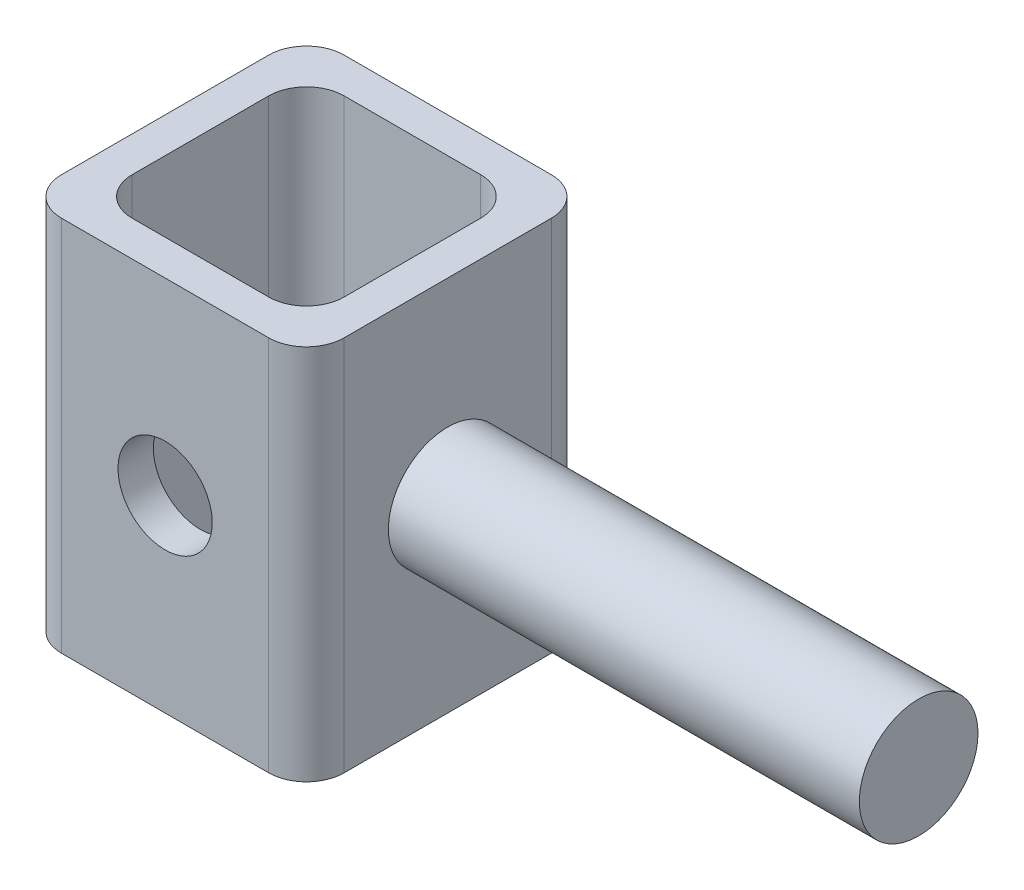
ISO-10303-21;
HEADER;
FILE_DESCRIPTION(('STEP AP214'),'2;1');
FILE_NAME('part.step','',(''),(''),'','','');
FILE_SCHEMA(('AUTOMOTIVE_DESIGN { 1 0 10303 214 1 1 1 1 }'));
ENDSEC;
DATA;
#1=APPLICATION_CONTEXT('core data for automotive mechanical design processes');
#2=APPLICATION_PROTOCOL_DEFINITION('international standard','automotive_design',2000,#1);
#3=PRODUCT_CONTEXT('',#1,'mechanical');
#4=PRODUCT('Part','Part','',(#3));
#5=PRODUCT_RELATED_PRODUCT_CATEGORY('part','',(#4));
#6=PRODUCT_DEFINITION_FORMATION('','',#4);
#7=PRODUCT_DEFINITION_CONTEXT('part definition',#1,'design');
#8=PRODUCT_DEFINITION('design','',#6,#7);
#9=PRODUCT_DEFINITION_SHAPE('','',#8);
#10=(LENGTH_UNIT() NAMED_UNIT(*) SI_UNIT(.MILLI.,.METRE.));
#11=(NAMED_UNIT(*) PLANE_ANGLE_UNIT() SI_UNIT($,.RADIAN.));
#12=(NAMED_UNIT(*) SI_UNIT($,.STERADIAN.) SOLID_ANGLE_UNIT());
#13=UNCERTAINTY_MEASURE_WITH_UNIT(LENGTH_MEASURE(1.E-05),#10,'distance_accuracy_value','');
#14=(GEOMETRIC_REPRESENTATION_CONTEXT(3) GLOBAL_UNCERTAINTY_ASSIGNED_CONTEXT((#13)) GLOBAL_UNIT_ASSIGNED_CONTEXT((#10,
#11,#12)) REPRESENTATION_CONTEXT('',''));
#15=CARTESIAN_POINT('',(0.,0.,0.));
#16=DIRECTION('',(0.,0.,1.));
#17=DIRECTION('',(1.,0.,0.));
#18=AXIS2_PLACEMENT_3D('',#15,#16,#17);
#19=CARTESIAN_POINT('',(0.,25.4,0.));
#20=DIRECTION('',(0.,-1.,0.));
#21=DIRECTION('',(0.,0.,-1.));
#22=AXIS2_PLACEMENT_3D('',#19,#20,#21);
#23=PLANE('',#22);
#24=DIRECTION('',(1.,0.,0.));
#25=VECTOR('',#24,1.);
#26=CARTESIAN_POINT('',(0.,25.4,0.));
#27=LINE('',#26,#25);
#28=CARTESIAN_POINT('',(2.54,25.4,0.));
#29=VERTEX_POINT('',#28);
#30=CARTESIAN_POINT('',(16.51,25.4,0.));
#31=VERTEX_POINT('',#30);
#32=EDGE_CURVE('E325',#29,#31,#27,.T.);
#33=ORIENTED_EDGE('',*,*,#32,.T.);
#34=CARTESIAN_POINT('',(16.51,25.4,-2.54));
#35=DIRECTION('',(0.,-1.,0.));
#36=DIRECTION('',(0.,0.,-1.));
#37=AXIS2_PLACEMENT_3D('',#34,#35,#36);
#38=CIRCLE('',#37,2.54);
#39=CARTESIAN_POINT('',(19.05,25.4,-2.54));
#40=VERTEX_POINT('',#39);
#41=EDGE_CURVE('E248',#31,#40,#38,.F.);
#42=ORIENTED_EDGE('',*,*,#41,.T.);
#43=DIRECTION('',(0.,0.,-1.));
#44=VECTOR('',#43,1.);
#45=CARTESIAN_POINT('',(19.05,25.4,0.));
#46=LINE('',#45,#44);
#47=CARTESIAN_POINT('',(19.05,25.4,-16.51));
#48=VERTEX_POINT('',#47);
#49=EDGE_CURVE('E329',#40,#48,#46,.T.);
#50=ORIENTED_EDGE('',*,*,#49,.T.);
#51=CARTESIAN_POINT('',(16.51,25.4,-16.51));
#52=DIRECTION('',(0.,-1.,0.));
#53=DIRECTION('',(0.,0.,-1.));
#54=AXIS2_PLACEMENT_3D('',#51,#52,#53);
#55=CIRCLE('',#54,2.54);
#56=CARTESIAN_POINT('',(16.51,25.4,-19.05));
#57=VERTEX_POINT('',#56);
#58=EDGE_CURVE('E62',#48,#57,#55,.F.);
#59=ORIENTED_EDGE('',*,*,#58,.T.);
#60=DIRECTION('',(-1.,0.,0.));
#61=VECTOR('',#60,1.);
#62=CARTESIAN_POINT('',(0.,25.4,-19.05));
#63=LINE('',#62,#61);
#64=CARTESIAN_POINT('',(2.54,25.4,-19.05));
#65=VERTEX_POINT('',#64);
#66=EDGE_CURVE('E189',#57,#65,#63,.T.);
#67=ORIENTED_EDGE('',*,*,#66,.T.);
#68=CARTESIAN_POINT('',(2.54,25.4,-16.51));
#69=DIRECTION('',(0.,-1.,0.));
#70=DIRECTION('',(0.,0.,-1.));
#71=AXIS2_PLACEMENT_3D('',#68,#69,#70);
#72=CIRCLE('',#71,2.54);
#73=CARTESIAN_POINT('',(0.,25.4,-16.51));
#74=VERTEX_POINT('',#73);
#75=EDGE_CURVE('E242',#65,#74,#72,.F.);
#76=ORIENTED_EDGE('',*,*,#75,.T.);
#77=DIRECTION('',(0.,0.,1.));
#78=VECTOR('',#77,1.);
#79=CARTESIAN_POINT('',(0.,25.4,0.));
#80=LINE('',#79,#78);
#81=CARTESIAN_POINT('',(0.,25.4,-2.54));
#82=VERTEX_POINT('',#81);
#83=EDGE_CURVE('E321',#74,#82,#80,.T.);
#84=ORIENTED_EDGE('',*,*,#83,.T.);
#85=CARTESIAN_POINT('',(2.54,25.4,-2.54));
#86=DIRECTION('',(0.,-1.,0.));
#87=DIRECTION('',(0.,0.,-1.));
#88=AXIS2_PLACEMENT_3D('',#85,#86,#87);
#89=CIRCLE('',#88,2.54);
#90=EDGE_CURVE('E245',#82,#29,#89,.F.);
#91=ORIENTED_EDGE('',*,*,#90,.T.);
#92=EDGE_LOOP('',(#33,#42,#50,#59,#67,#76,#84,#91));
#93=FACE_BOUND('',#92,.T.);
#94=DIRECTION('',(0.,0.,1.));
#95=VECTOR('',#94,1.);
#96=CARTESIAN_POINT('',(2.38125,25.4,-2.38125));
#97=LINE('',#96,#95);
#98=CARTESIAN_POINT('',(2.38125,25.4,-14.12875));
#99=VERTEX_POINT('',#98);
#100=CARTESIAN_POINT('',(2.38125,25.4,-4.92125));
#101=VERTEX_POINT('',#100);
#102=EDGE_CURVE('E300',#99,#101,#97,.T.);
#103=ORIENTED_EDGE('',*,*,#102,.F.);
#104=CARTESIAN_POINT('',(4.92125,25.4,-14.12875));
#105=DIRECTION('',(0.,-1.,0.));
#106=DIRECTION('',(0.,0.,-1.));
#107=AXIS2_PLACEMENT_3D('',#104,#105,#106);
#108=CIRCLE('',#107,2.54);
#109=CARTESIAN_POINT('',(4.92125,25.4,-16.66875));
#110=VERTEX_POINT('',#109);
#111=EDGE_CURVE('E11',#99,#110,#108,.T.);
#112=ORIENTED_EDGE('',*,*,#111,.T.);
#113=DIRECTION('',(-1.,0.,0.));
#114=VECTOR('',#113,1.);
#115=CARTESIAN_POINT('',(2.38125,25.4,-16.66875));
#116=LINE('',#115,#114);
#117=CARTESIAN_POINT('',(14.12875,25.4,-16.66875));
#118=VERTEX_POINT('',#117);
#119=EDGE_CURVE('E298',#118,#110,#116,.T.);
#120=ORIENTED_EDGE('',*,*,#119,.F.);
#121=CARTESIAN_POINT('',(14.12875,25.4,-14.12875));
#122=DIRECTION('',(0.,-1.,0.));
#123=DIRECTION('',(0.,0.,-1.));
#124=AXIS2_PLACEMENT_3D('',#121,#122,#123);
#125=CIRCLE('',#124,2.54);
#126=CARTESIAN_POINT('',(16.66875,25.4,-14.12875));
#127=VERTEX_POINT('',#126);
#128=EDGE_CURVE('E166',#118,#127,#125,.T.);
#129=ORIENTED_EDGE('',*,*,#128,.T.);
#130=DIRECTION('',(0.,0.,-1.));
#131=VECTOR('',#130,1.);
#132=CARTESIAN_POINT('',(16.66875,25.4,-2.38125));
#133=LINE('',#132,#131);
#134=CARTESIAN_POINT('',(16.66875,25.4,-4.92125));
#135=VERTEX_POINT('',#134);
#136=EDGE_CURVE('E306',#135,#127,#133,.T.);
#137=ORIENTED_EDGE('',*,*,#136,.F.);
#138=CARTESIAN_POINT('',(14.12875,25.4,-4.92125));
#139=DIRECTION('',(0.,-1.,0.));
#140=DIRECTION('',(0.,0.,-1.));
#141=AXIS2_PLACEMENT_3D('',#138,#139,#140);
#142=CIRCLE('',#141,2.54);
#143=CARTESIAN_POINT('',(14.12875,25.4,-2.38125));
#144=VERTEX_POINT('',#143);
#145=EDGE_CURVE('E165',#135,#144,#142,.T.);
#146=ORIENTED_EDGE('',*,*,#145,.T.);
#147=DIRECTION('',(1.,0.,0.));
#148=VECTOR('',#147,1.);
#149=CARTESIAN_POINT('',(2.38125,25.4,-2.38125));
#150=LINE('',#149,#148);
#151=CARTESIAN_POINT('',(4.92125,25.4,-2.38125));
#152=VERTEX_POINT('',#151);
#153=EDGE_CURVE('E313',#152,#144,#150,.T.);
#154=ORIENTED_EDGE('',*,*,#153,.F.);
#155=CARTESIAN_POINT('',(4.92125,25.4,-4.92125));
#156=DIRECTION('',(0.,-1.,0.));
#157=DIRECTION('',(0.,0.,-1.));
#158=AXIS2_PLACEMENT_3D('',#155,#156,#157);
#159=CIRCLE('',#158,2.54);
#160=EDGE_CURVE('E274',#152,#101,#159,.T.);
#161=ORIENTED_EDGE('',*,*,#160,.T.);
#162=EDGE_LOOP('',(#103,#112,#120,#129,#137,#146,#154,#161));
#163=FACE_BOUND('',#162,.T.);
#164=ADVANCED_FACE('F39',(#93,#163),#23,.F.);
#165=CARTESIAN_POINT('',(0.,0.,0.));
#166=DIRECTION('',(0.,-1.,0.));
#167=DIRECTION('',(0.,0.,-1.));
#168=AXIS2_PLACEMENT_3D('',#165,#166,#167);
#169=PLANE('',#168);
#170=DIRECTION('',(0.,0.,-1.));
#171=VECTOR('',#170,1.);
#172=CARTESIAN_POINT('',(19.05,0.,0.));
#173=LINE('',#172,#171);
#174=CARTESIAN_POINT('',(19.05,0.,-2.54));
#175=VERTEX_POINT('',#174);
#176=CARTESIAN_POINT('',(19.05,0.,-16.51));
#177=VERTEX_POINT('',#176);
#178=EDGE_CURVE('E336',#175,#177,#173,.T.);
#179=ORIENTED_EDGE('',*,*,#178,.F.);
#180=CARTESIAN_POINT('',(16.51,0.,-2.54));
#181=DIRECTION('',(0.,-1.,0.));
#182=DIRECTION('',(0.,0.,-1.));
#183=AXIS2_PLACEMENT_3D('',#180,#181,#182);
#184=CIRCLE('',#183,2.54);
#185=CARTESIAN_POINT('',(16.51,0.,0.));
#186=VERTEX_POINT('',#185);
#187=EDGE_CURVE('E230',#175,#186,#184,.T.);
#188=ORIENTED_EDGE('',*,*,#187,.T.);
#189=DIRECTION('',(1.,0.,0.));
#190=VECTOR('',#189,1.);
#191=CARTESIAN_POINT('',(0.,0.,0.));
#192=LINE('',#191,#190);
#193=CARTESIAN_POINT('',(2.54,0.,0.));
#194=VERTEX_POINT('',#193);
#195=EDGE_CURVE('E311',#194,#186,#192,.T.);
#196=ORIENTED_EDGE('',*,*,#195,.F.);
#197=CARTESIAN_POINT('',(2.54,0.,-2.54));
#198=DIRECTION('',(0.,-1.,0.));
#199=DIRECTION('',(0.,0.,-1.));
#200=AXIS2_PLACEMENT_3D('',#197,#198,#199);
#201=CIRCLE('',#200,2.54);
#202=CARTESIAN_POINT('',(0.,0.,-2.54));
#203=VERTEX_POINT('',#202);
#204=EDGE_CURVE('E227',#194,#203,#201,.T.);
#205=ORIENTED_EDGE('',*,*,#204,.T.);
#206=DIRECTION('',(0.,0.,1.));
#207=VECTOR('',#206,1.);
#208=CARTESIAN_POINT('',(0.,0.,0.));
#209=LINE('',#208,#207);
#210=CARTESIAN_POINT('',(0.,0.,-16.51));
#211=VERTEX_POINT('',#210);
#212=EDGE_CURVE('E305',#211,#203,#209,.T.);
#213=ORIENTED_EDGE('',*,*,#212,.F.);
#214=CARTESIAN_POINT('',(2.54,0.,-16.51));
#215=DIRECTION('',(0.,-1.,0.));
#216=DIRECTION('',(0.,0.,-1.));
#217=AXIS2_PLACEMENT_3D('',#214,#215,#216);
#218=CIRCLE('',#217,2.54);
#219=CARTESIAN_POINT('',(2.54,0.,-19.05));
#220=VERTEX_POINT('',#219);
#221=EDGE_CURVE('E224',#211,#220,#218,.T.);
#222=ORIENTED_EDGE('',*,*,#221,.T.);
#223=DIRECTION('',(-1.,0.,0.));
#224=VECTOR('',#223,1.);
#225=CARTESIAN_POINT('',(0.,0.,-19.05));
#226=LINE('',#225,#224);
#227=CARTESIAN_POINT('',(16.51,0.,-19.05));
#228=VERTEX_POINT('',#227);
#229=EDGE_CURVE('E192',#228,#220,#226,.T.);
#230=ORIENTED_EDGE('',*,*,#229,.F.);
#231=CARTESIAN_POINT('',(16.51,0.,-16.51));
#232=DIRECTION('',(0.,-1.,0.));
#233=DIRECTION('',(0.,0.,-1.));
#234=AXIS2_PLACEMENT_3D('',#231,#232,#233);
#235=CIRCLE('',#234,2.54);
#236=EDGE_CURVE('E221',#228,#177,#235,.T.);
#237=ORIENTED_EDGE('',*,*,#236,.T.);
#238=EDGE_LOOP('',(#179,#188,#196,#205,#213,#222,#230,#237));
#239=FACE_BOUND('',#238,.T.);
#240=DIRECTION('',(0.,0.,-1.));
#241=VECTOR('',#240,1.);
#242=CARTESIAN_POINT('',(16.66875,0.,-2.38125));
#243=LINE('',#242,#241);
#244=CARTESIAN_POINT('',(16.66875,0.,-4.92125));
#245=VERTEX_POINT('',#244);
#246=CARTESIAN_POINT('',(16.66875,0.,-14.12875));
#247=VERTEX_POINT('',#246);
#248=EDGE_CURVE('E157',#245,#247,#243,.T.);
#249=ORIENTED_EDGE('',*,*,#248,.T.);
#250=CARTESIAN_POINT('',(14.12875,0.,-14.12875));
#251=DIRECTION('',(0.,-1.,0.));
#252=DIRECTION('',(0.,0.,-1.));
#253=AXIS2_PLACEMENT_3D('',#250,#251,#252);
#254=CIRCLE('',#253,2.54);
#255=CARTESIAN_POINT('',(14.12875,0.,-16.66875));
#256=VERTEX_POINT('',#255);
#257=EDGE_CURVE('E264',#247,#256,#254,.F.);
#258=ORIENTED_EDGE('',*,*,#257,.T.);
#259=DIRECTION('',(-1.,0.,0.));
#260=VECTOR('',#259,1.);
#261=CARTESIAN_POINT('',(2.38125,0.,-16.66875));
#262=LINE('',#261,#260);
#263=CARTESIAN_POINT('',(4.92125,0.,-16.66875));
#264=VERTEX_POINT('',#263);
#265=EDGE_CURVE('E177',#256,#264,#262,.T.);
#266=ORIENTED_EDGE('',*,*,#265,.T.);
#267=CARTESIAN_POINT('',(4.92125,0.,-14.12875));
#268=DIRECTION('',(0.,-1.,0.));
#269=DIRECTION('',(0.,0.,-1.));
#270=AXIS2_PLACEMENT_3D('',#267,#268,#269);
#271=CIRCLE('',#270,2.54);
#272=CARTESIAN_POINT('',(2.38125,0.,-14.12875));
#273=VERTEX_POINT('',#272);
#274=EDGE_CURVE('E48',#264,#273,#271,.F.);
#275=ORIENTED_EDGE('',*,*,#274,.T.);
#276=DIRECTION('',(0.,0.,1.));
#277=VECTOR('',#276,1.);
#278=CARTESIAN_POINT('',(2.38125,0.,-2.38125));
#279=LINE('',#278,#277);
#280=CARTESIAN_POINT('',(2.38125,0.,-4.92125));
#281=VERTEX_POINT('',#280);
#282=EDGE_CURVE('E280',#273,#281,#279,.T.);
#283=ORIENTED_EDGE('',*,*,#282,.T.);
#284=CARTESIAN_POINT('',(4.92125,0.,-4.92125));
#285=DIRECTION('',(0.,-1.,0.));
#286=DIRECTION('',(0.,0.,-1.));
#287=AXIS2_PLACEMENT_3D('',#284,#285,#286);
#288=CIRCLE('',#287,2.54);
#289=CARTESIAN_POINT('',(4.92125,0.,-2.38125));
#290=VERTEX_POINT('',#289);
#291=EDGE_CURVE('E271',#281,#290,#288,.F.);
#292=ORIENTED_EDGE('',*,*,#291,.T.);
#293=DIRECTION('',(1.,0.,0.));
#294=VECTOR('',#293,1.);
#295=CARTESIAN_POINT('',(2.38125,0.,-2.38125));
#296=LINE('',#295,#294);
#297=CARTESIAN_POINT('',(14.12875,0.,-2.38125));
#298=VERTEX_POINT('',#297);
#299=EDGE_CURVE('E159',#290,#298,#296,.T.);
#300=ORIENTED_EDGE('',*,*,#299,.T.);
#301=CARTESIAN_POINT('',(14.12875,0.,-4.92125));
#302=DIRECTION('',(0.,-1.,0.));
#303=DIRECTION('',(0.,0.,-1.));
#304=AXIS2_PLACEMENT_3D('',#301,#302,#303);
#305=CIRCLE('',#304,2.54);
#306=EDGE_CURVE('E154',#298,#245,#305,.F.);
#307=ORIENTED_EDGE('',*,*,#306,.T.);
#308=EDGE_LOOP('',(#249,#258,#266,#275,#283,#292,#300,#307));
#309=FACE_BOUND('',#308,.T.);
#310=ADVANCED_FACE('F156',(#239,#309),#169,.T.);
#311=CARTESIAN_POINT('',(0.,25.4,0.));
#312=DIRECTION('',(1.,0.,0.));
#313=DIRECTION('',(0.,0.,-1.));
#314=AXIS2_PLACEMENT_3D('',#311,#312,#313);
#315=PLANE('',#314);
#316=ORIENTED_EDGE('',*,*,#212,.T.);
#317=DIRECTION('',(0.,-1.,0.));
#318=VECTOR('',#317,1.);
#319=CARTESIAN_POINT('',(0.,25.4,-2.54));
#320=LINE('',#319,#318);
#321=EDGE_CURVE('E255',#203,#82,#320,.F.);
#322=ORIENTED_EDGE('',*,*,#321,.T.);
#323=ORIENTED_EDGE('',*,*,#83,.F.);
#324=DIRECTION('',(0.,-1.,0.));
#325=VECTOR('',#324,1.);
#326=CARTESIAN_POINT('',(0.,25.4,-16.51));
#327=LINE('',#326,#325);
#328=EDGE_CURVE('E251',#74,#211,#327,.T.);
#329=ORIENTED_EDGE('',*,*,#328,.T.);
#330=EDGE_LOOP('',(#316,#322,#323,#329));
#331=FACE_BOUND('',#330,.T.);
#332=ADVANCED_FACE('F354',(#331),#315,.F.);
#333=CARTESIAN_POINT('',(0.,25.4,0.));
#334=DIRECTION('',(0.,0.,-1.));
#335=DIRECTION('',(-1.,0.,0.));
#336=AXIS2_PLACEMENT_3D('',#333,#334,#335);
#337=PLANE('',#336);
#338=CARTESIAN_POINT('',(9.525,12.7,0.));
#339=DIRECTION('',(0.,0.,1.));
#340=DIRECTION('',(1.,0.,0.));
#341=AXIS2_PLACEMENT_3D('',#338,#339,#340);
#342=CIRCLE('',#341,3.175);
#343=CARTESIAN_POINT('',(12.7,12.7,0.));
#344=VERTEX_POINT('',#343);
#345=EDGE_CURVE('E291',#344,#344,#342,.T.);
#346=ORIENTED_EDGE('',*,*,#345,.F.);
#347=EDGE_LOOP('',(#346));
#348=FACE_BOUND('',#347,.T.);
#349=ORIENTED_EDGE('',*,*,#195,.T.);
#350=DIRECTION('',(0.,-1.,0.));
#351=VECTOR('',#350,1.);
#352=CARTESIAN_POINT('',(16.51,25.4,0.));
#353=LINE('',#352,#351);
#354=EDGE_CURVE('E237',#186,#31,#353,.F.);
#355=ORIENTED_EDGE('',*,*,#354,.T.);
#356=ORIENTED_EDGE('',*,*,#32,.F.);
#357=DIRECTION('',(0.,-1.,0.));
#358=VECTOR('',#357,1.);
#359=CARTESIAN_POINT('',(2.54,25.4,0.));
#360=LINE('',#359,#358);
#361=EDGE_CURVE('E233',#29,#194,#360,.T.);
#362=ORIENTED_EDGE('',*,*,#361,.T.);
#363=EDGE_LOOP('',(#349,#355,#356,#362));
#364=FACE_BOUND('',#363,.T.);
#365=ADVANCED_FACE('F363',(#348,#364),#337,.F.);
#366=CARTESIAN_POINT('',(19.05,25.4,0.));
#367=DIRECTION('',(-1.,0.,0.));
#368=DIRECTION('',(0.,0.,1.));
#369=AXIS2_PLACEMENT_3D('',#366,#367,#368);
#370=PLANE('',#369);
#371=CARTESIAN_POINT('',(19.05,12.7,-9.525));
#372=DIRECTION('',(1.,0.,0.));
#373=DIRECTION('',(0.,0.,-1.));
#374=AXIS2_PLACEMENT_3D('',#371,#372,#373);
#375=CIRCLE('',#374,4.);
#376=CARTESIAN_POINT('',(19.05,12.7,-13.525));
#377=VERTEX_POINT('',#376);
#378=EDGE_CURVE('E182',#377,#377,#375,.T.);
#379=ORIENTED_EDGE('',*,*,#378,.F.);
#380=EDGE_LOOP('',(#379));
#381=FACE_BOUND('',#380,.T.);
#382=ORIENTED_EDGE('',*,*,#49,.F.);
#383=DIRECTION('',(0.,-1.,0.));
#384=VECTOR('',#383,1.);
#385=CARTESIAN_POINT('',(19.05,25.4,-2.54));
#386=LINE('',#385,#384);
#387=EDGE_CURVE('E217',#40,#175,#386,.T.);
#388=ORIENTED_EDGE('',*,*,#387,.T.);
#389=ORIENTED_EDGE('',*,*,#178,.T.);
#390=DIRECTION('',(0.,-1.,0.));
#391=VECTOR('',#390,1.);
#392=CARTESIAN_POINT('',(19.05,25.4,-16.51));
#393=LINE('',#392,#391);
#394=EDGE_CURVE('E214',#177,#48,#393,.F.);
#395=ORIENTED_EDGE('',*,*,#394,.T.);
#396=EDGE_LOOP('',(#382,#388,#389,#395));
#397=FACE_BOUND('',#396,.T.);
#398=ADVANCED_FACE('F370',(#381,#397),#370,.F.);
#399=CARTESIAN_POINT('',(0.,25.4,-19.05));
#400=DIRECTION('',(0.,0.,1.));
#401=DIRECTION('',(1.,0.,0.));
#402=AXIS2_PLACEMENT_3D('',#399,#400,#401);
#403=PLANE('',#402);
#404=ORIENTED_EDGE('',*,*,#229,.T.);
#405=DIRECTION('',(0.,-1.,0.));
#406=VECTOR('',#405,1.);
#407=CARTESIAN_POINT('',(2.54,25.4,-19.05));
#408=LINE('',#407,#406);
#409=EDGE_CURVE('E55',#220,#65,#408,.F.);
#410=ORIENTED_EDGE('',*,*,#409,.T.);
#411=ORIENTED_EDGE('',*,*,#66,.F.);
#412=DIRECTION('',(0.,-1.,0.));
#413=VECTOR('',#412,1.);
#414=CARTESIAN_POINT('',(16.51,25.4,-19.05));
#415=LINE('',#414,#413);
#416=EDGE_CURVE('E258',#57,#228,#415,.T.);
#417=ORIENTED_EDGE('',*,*,#416,.T.);
#418=EDGE_LOOP('',(#404,#410,#411,#417));
#419=FACE_BOUND('',#418,.T.);
#420=ADVANCED_FACE('F344',(#419),#403,.F.);
#421=CARTESIAN_POINT('',(2.38125,25.4,-2.38125));
#422=DIRECTION('',(1.,0.,0.));
#423=DIRECTION('',(0.,0.,-1.));
#424=AXIS2_PLACEMENT_3D('',#421,#422,#423);
#425=PLANE('',#424);
#426=ORIENTED_EDGE('',*,*,#102,.T.);
#427=DIRECTION('',(0.,-1.,0.));
#428=VECTOR('',#427,1.);
#429=CARTESIAN_POINT('',(2.38125,0.,-4.92125));
#430=LINE('',#429,#428);
#431=EDGE_CURVE('E210',#101,#281,#430,.T.);
#432=ORIENTED_EDGE('',*,*,#431,.T.);
#433=ORIENTED_EDGE('',*,*,#282,.F.);
#434=DIRECTION('',(0.,-1.,0.));
#435=VECTOR('',#434,1.);
#436=CARTESIAN_POINT('',(2.38125,25.4,-14.12875));
#437=LINE('',#436,#435);
#438=EDGE_CURVE('E207',#273,#99,#437,.F.);
#439=ORIENTED_EDGE('',*,*,#438,.T.);
#440=EDGE_LOOP('',(#426,#432,#433,#439));
#441=FACE_BOUND('',#440,.T.);
#442=ADVANCED_FACE('F287',(#441),#425,.T.);
#443=CARTESIAN_POINT('',(2.38125,25.4,-2.38125));
#444=DIRECTION('',(0.,0.,-1.));
#445=DIRECTION('',(-1.,0.,0.));
#446=AXIS2_PLACEMENT_3D('',#443,#444,#445);
#447=PLANE('',#446);
#448=CARTESIAN_POINT('',(9.525,12.7,-2.38125));
#449=DIRECTION('',(0.,0.,-1.));
#450=DIRECTION('',(-1.,0.,0.));
#451=AXIS2_PLACEMENT_3D('',#448,#449,#450);
#452=CIRCLE('',#451,3.175);
#453=CARTESIAN_POINT('',(6.35,12.7,-2.38125));
#454=VERTEX_POINT('',#453);
#455=EDGE_CURVE('E555',#454,#454,#452,.F.);
#456=ORIENTED_EDGE('',*,*,#455,.T.);
#457=EDGE_LOOP('',(#456));
#458=FACE_BOUND('',#457,.T.);
#459=ORIENTED_EDGE('',*,*,#153,.T.);
#460=DIRECTION('',(0.,-1.,0.));
#461=VECTOR('',#460,1.);
#462=CARTESIAN_POINT('',(14.12875,0.,-2.38125));
#463=LINE('',#462,#461);
#464=EDGE_CURVE('E204',#144,#298,#463,.T.);
#465=ORIENTED_EDGE('',*,*,#464,.T.);
#466=ORIENTED_EDGE('',*,*,#299,.F.);
#467=DIRECTION('',(0.,-1.,0.));
#468=VECTOR('',#467,1.);
#469=CARTESIAN_POINT('',(4.92125,25.4,-2.38125));
#470=LINE('',#469,#468);
#471=EDGE_CURVE('E201',#290,#152,#470,.F.);
#472=ORIENTED_EDGE('',*,*,#471,.T.);
#473=EDGE_LOOP('',(#459,#465,#466,#472));
#474=FACE_BOUND('',#473,.T.);
#475=ADVANCED_FACE('F474',(#458,#474),#447,.T.);
#476=CARTESIAN_POINT('',(16.66875,25.4,-2.38125));
#477=DIRECTION('',(-1.,0.,0.));
#478=DIRECTION('',(0.,0.,1.));
#479=AXIS2_PLACEMENT_3D('',#476,#477,#478);
#480=PLANE('',#479);
#481=ORIENTED_EDGE('',*,*,#136,.T.);
#482=DIRECTION('',(0.,-1.,0.));
#483=VECTOR('',#482,1.);
#484=CARTESIAN_POINT('',(16.66875,0.,-14.12875));
#485=LINE('',#484,#483);
#486=EDGE_CURVE('E175',#127,#247,#485,.T.);
#487=ORIENTED_EDGE('',*,*,#486,.T.);
#488=ORIENTED_EDGE('',*,*,#248,.F.);
#489=DIRECTION('',(0.,-1.,0.));
#490=VECTOR('',#489,1.);
#491=CARTESIAN_POINT('',(16.66875,25.4,-4.92125));
#492=LINE('',#491,#490);
#493=EDGE_CURVE('E172',#245,#135,#492,.F.);
#494=ORIENTED_EDGE('',*,*,#493,.T.);
#495=EDGE_LOOP('',(#481,#487,#488,#494));
#496=FACE_BOUND('',#495,.T.);
#497=ADVANCED_FACE('F171',(#496),#480,.T.);
#498=CARTESIAN_POINT('',(2.38125,25.4,-16.66875));
#499=DIRECTION('',(0.,0.,1.));
#500=DIRECTION('',(1.,0.,0.));
#501=AXIS2_PLACEMENT_3D('',#498,#499,#500);
#502=PLANE('',#501);
#503=ORIENTED_EDGE('',*,*,#265,.F.);
#504=DIRECTION('',(0.,-1.,0.));
#505=VECTOR('',#504,1.);
#506=CARTESIAN_POINT('',(14.12875,25.4,-16.66875));
#507=LINE('',#506,#505);
#508=EDGE_CURVE('E198',#256,#118,#507,.F.);
#509=ORIENTED_EDGE('',*,*,#508,.T.);
#510=ORIENTED_EDGE('',*,*,#119,.T.);
#511=DIRECTION('',(0.,-1.,0.));
#512=VECTOR('',#511,1.);
#513=CARTESIAN_POINT('',(4.92125,0.,-16.66875));
#514=LINE('',#513,#512);
#515=EDGE_CURVE('E186',#110,#264,#514,.T.);
#516=ORIENTED_EDGE('',*,*,#515,.T.);
#517=EDGE_LOOP('',(#503,#509,#510,#516));
#518=FACE_BOUND('',#517,.T.);
#519=ADVANCED_FACE('F302',(#518),#502,.T.);
#520=CARTESIAN_POINT('',(9.525,12.7,-19.051));
#521=DIRECTION('',(0.,0.,1.));
#522=DIRECTION('',(1.,0.,0.));
#523=AXIS2_PLACEMENT_3D('',#520,#521,#522);
#524=CYLINDRICAL_SURFACE('',#523,3.175);
#525=ORIENTED_EDGE('',*,*,#455,.F.);
#526=EDGE_LOOP('',(#525));
#527=FACE_BOUND('',#526,.T.);
#528=ORIENTED_EDGE('',*,*,#345,.T.);
#529=EDGE_LOOP('',(#528));
#530=FACE_BOUND('',#529,.T.);
#531=ADVANCED_FACE('F463',(#527,#530),#524,.F.);
#532=CARTESIAN_POINT('',(50.8,12.7,-9.525));
#533=DIRECTION('',(-1.,0.,0.));
#534=DIRECTION('',(0.,0.,1.));
#535=AXIS2_PLACEMENT_3D('',#532,#533,#534);
#536=CYLINDRICAL_SURFACE('',#535,4.);
#537=CARTESIAN_POINT('',(50.8,12.7,-9.525));
#538=DIRECTION('',(1.,0.,0.));
#539=DIRECTION('',(0.,0.,-1.));
#540=AXIS2_PLACEMENT_3D('',#537,#538,#539);
#541=CIRCLE('',#540,4.);
#542=CARTESIAN_POINT('',(50.8,12.7,-13.525));
#543=VERTEX_POINT('',#542);
#544=EDGE_CURVE('E561',#543,#543,#541,.T.);
#545=ORIENTED_EDGE('',*,*,#544,.F.);
#546=EDGE_LOOP('',(#545));
#547=FACE_BOUND('',#546,.T.);
#548=ORIENTED_EDGE('',*,*,#378,.T.);
#549=EDGE_LOOP('',(#548));
#550=FACE_BOUND('',#549,.T.);
#551=ADVANCED_FACE('F531',(#547,#550),#536,.T.);
#552=CARTESIAN_POINT('',(50.8,12.7,-9.525));
#553=DIRECTION('',(1.,0.,0.));
#554=DIRECTION('',(0.,0.,-1.));
#555=AXIS2_PLACEMENT_3D('',#552,#553,#554);
#556=PLANE('',#555);
#557=ORIENTED_EDGE('',*,*,#544,.T.);
#558=EDGE_LOOP('',(#557));
#559=FACE_BOUND('',#558,.T.);
#560=ADVANCED_FACE('F393',(#559),#556,.T.);
#561=CARTESIAN_POINT('',(14.12875,25.4,-14.12875));
#562=DIRECTION('',(0.,1.,0.));
#563=DIRECTION('',(0.,0.,1.));
#564=AXIS2_PLACEMENT_3D('',#561,#562,#563);
#565=CYLINDRICAL_SURFACE('',#564,2.54);
#566=ORIENTED_EDGE('',*,*,#128,.F.);
#567=ORIENTED_EDGE('',*,*,#508,.F.);
#568=ORIENTED_EDGE('',*,*,#257,.F.);
#569=ORIENTED_EDGE('',*,*,#486,.F.);
#570=EDGE_LOOP('',(#566,#567,#568,#569));
#571=FACE_BOUND('',#570,.T.);
#572=ADVANCED_FACE('F390',(#571),#565,.F.);
#573=CARTESIAN_POINT('',(14.12875,25.4,-4.92125));
#574=DIRECTION('',(0.,1.,0.));
#575=DIRECTION('',(0.,0.,1.));
#576=AXIS2_PLACEMENT_3D('',#573,#574,#575);
#577=CYLINDRICAL_SURFACE('',#576,2.54);
#578=ORIENTED_EDGE('',*,*,#145,.F.);
#579=ORIENTED_EDGE('',*,*,#493,.F.);
#580=ORIENTED_EDGE('',*,*,#306,.F.);
#581=ORIENTED_EDGE('',*,*,#464,.F.);
#582=EDGE_LOOP('',(#578,#579,#580,#581));
#583=FACE_BOUND('',#582,.T.);
#584=ADVANCED_FACE('F180',(#583),#577,.F.);
#585=CARTESIAN_POINT('',(4.92125,25.4,-4.92125));
#586=DIRECTION('',(0.,1.,0.));
#587=DIRECTION('',(0.,0.,1.));
#588=AXIS2_PLACEMENT_3D('',#585,#586,#587);
#589=CYLINDRICAL_SURFACE('',#588,2.54);
#590=ORIENTED_EDGE('',*,*,#160,.F.);
#591=ORIENTED_EDGE('',*,*,#471,.F.);
#592=ORIENTED_EDGE('',*,*,#291,.F.);
#593=ORIENTED_EDGE('',*,*,#431,.F.);
#594=EDGE_LOOP('',(#590,#591,#592,#593));
#595=FACE_BOUND('',#594,.T.);
#596=ADVANCED_FACE('F397',(#595),#589,.F.);
#597=CARTESIAN_POINT('',(4.92125,25.4,-14.12875));
#598=DIRECTION('',(0.,1.,0.));
#599=DIRECTION('',(0.,0.,1.));
#600=AXIS2_PLACEMENT_3D('',#597,#598,#599);
#601=CYLINDRICAL_SURFACE('',#600,2.54);
#602=ORIENTED_EDGE('',*,*,#111,.F.);
#603=ORIENTED_EDGE('',*,*,#438,.F.);
#604=ORIENTED_EDGE('',*,*,#274,.F.);
#605=ORIENTED_EDGE('',*,*,#515,.F.);
#606=EDGE_LOOP('',(#602,#603,#604,#605));
#607=FACE_BOUND('',#606,.T.);
#608=ADVANCED_FACE('F294',(#607),#601,.F.);
#609=CARTESIAN_POINT('',(16.51,25.4,-2.54));
#610=DIRECTION('',(0.,-1.,0.));
#611=DIRECTION('',(0.,0.,-1.));
#612=AXIS2_PLACEMENT_3D('',#609,#610,#611);
#613=CYLINDRICAL_SURFACE('',#612,2.54);
#614=ORIENTED_EDGE('',*,*,#41,.F.);
#615=ORIENTED_EDGE('',*,*,#354,.F.);
#616=ORIENTED_EDGE('',*,*,#187,.F.);
#617=ORIENTED_EDGE('',*,*,#387,.F.);
#618=EDGE_LOOP('',(#614,#615,#616,#617));
#619=FACE_BOUND('',#618,.T.);
#620=ADVANCED_FACE('F367',(#619),#613,.T.);
#621=CARTESIAN_POINT('',(2.54,25.4,-2.54));
#622=DIRECTION('',(0.,-1.,0.));
#623=DIRECTION('',(0.,0.,-1.));
#624=AXIS2_PLACEMENT_3D('',#621,#622,#623);
#625=CYLINDRICAL_SURFACE('',#624,2.54);
#626=ORIENTED_EDGE('',*,*,#90,.F.);
#627=ORIENTED_EDGE('',*,*,#321,.F.);
#628=ORIENTED_EDGE('',*,*,#204,.F.);
#629=ORIENTED_EDGE('',*,*,#361,.F.);
#630=EDGE_LOOP('',(#626,#627,#628,#629));
#631=FACE_BOUND('',#630,.T.);
#632=ADVANCED_FACE('F358',(#631),#625,.T.);
#633=CARTESIAN_POINT('',(2.54,25.4,-16.51));
#634=DIRECTION('',(0.,-1.,0.));
#635=DIRECTION('',(0.,0.,-1.));
#636=AXIS2_PLACEMENT_3D('',#633,#634,#635);
#637=CYLINDRICAL_SURFACE('',#636,2.54);
#638=ORIENTED_EDGE('',*,*,#75,.F.);
#639=ORIENTED_EDGE('',*,*,#409,.F.);
#640=ORIENTED_EDGE('',*,*,#221,.F.);
#641=ORIENTED_EDGE('',*,*,#328,.F.);
#642=EDGE_LOOP('',(#638,#639,#640,#641));
#643=FACE_BOUND('',#642,.T.);
#644=ADVANCED_FACE('F349',(#643),#637,.T.);
#645=CARTESIAN_POINT('',(16.51,25.4,-16.51));
#646=DIRECTION('',(0.,-1.,0.));
#647=DIRECTION('',(0.,0.,-1.));
#648=AXIS2_PLACEMENT_3D('',#645,#646,#647);
#649=CYLINDRICAL_SURFACE('',#648,2.54);
#650=ORIENTED_EDGE('',*,*,#58,.F.);
#651=ORIENTED_EDGE('',*,*,#394,.F.);
#652=ORIENTED_EDGE('',*,*,#236,.F.);
#653=ORIENTED_EDGE('',*,*,#416,.F.);
#654=EDGE_LOOP('',(#650,#651,#652,#653));
#655=FACE_BOUND('',#654,.T.);
#656=ADVANCED_FACE('F41',(#655),#649,.T.);
#657=CLOSED_SHELL('',(#164,#310,#332,#365,#398,#420,#442,#475,#497,#519,#531,#551,#560,#572,
#584,#596,#608,#620,#632,#644,#656));
#658=MANIFOLD_SOLID_BREP('B2',#657);
#659=ADVANCED_BREP_SHAPE_REPRESENTATION('',(#18,#658),#14);
#660=SHAPE_DEFINITION_REPRESENTATION(#9,#659);
ENDSEC;
END-ISO-10303-21;
